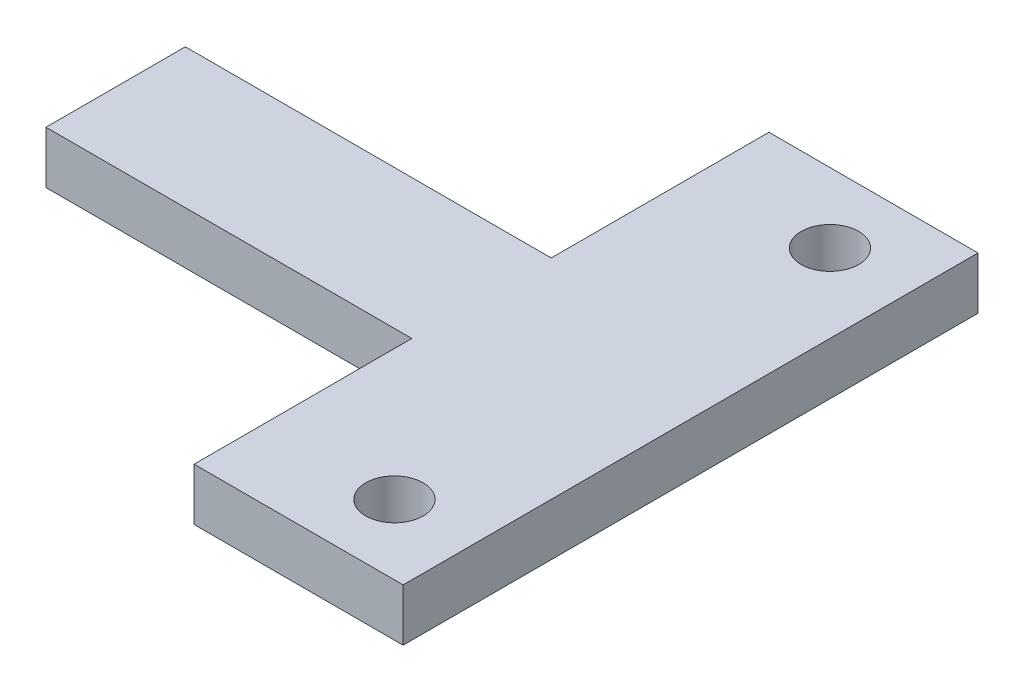
ISO-10303-21;
HEADER;
FILE_DESCRIPTION(('STEP AP214'),'2;1');
FILE_NAME('part.step','',(''),(''),'','','');
FILE_SCHEMA(('AUTOMOTIVE_DESIGN { 1 0 10303 214 1 1 1 1 }'));
ENDSEC;
DATA;
#1=APPLICATION_CONTEXT('core data for automotive mechanical design processes');
#2=APPLICATION_PROTOCOL_DEFINITION('international standard','automotive_design',2000,#1);
#3=PRODUCT_CONTEXT('',#1,'mechanical');
#4=PRODUCT('Part','Part','',(#3));
#5=PRODUCT_RELATED_PRODUCT_CATEGORY('part','',(#4));
#6=PRODUCT_DEFINITION_FORMATION('','',#4);
#7=PRODUCT_DEFINITION_CONTEXT('part definition',#1,'design');
#8=PRODUCT_DEFINITION('design','',#6,#7);
#9=PRODUCT_DEFINITION_SHAPE('','',#8);
#10=(LENGTH_UNIT() NAMED_UNIT(*) SI_UNIT(.MILLI.,.METRE.));
#11=(NAMED_UNIT(*) PLANE_ANGLE_UNIT() SI_UNIT($,.RADIAN.));
#12=(NAMED_UNIT(*) SI_UNIT($,.STERADIAN.) SOLID_ANGLE_UNIT());
#13=UNCERTAINTY_MEASURE_WITH_UNIT(LENGTH_MEASURE(1.E-05),#10,'distance_accuracy_value','');
#14=(GEOMETRIC_REPRESENTATION_CONTEXT(3) GLOBAL_UNCERTAINTY_ASSIGNED_CONTEXT((#13)) GLOBAL_UNIT_ASSIGNED_CONTEXT((#10,
#11,#12)) REPRESENTATION_CONTEXT('',''));
#15=CARTESIAN_POINT('',(0.,0.,0.));
#16=DIRECTION('',(0.,0.,1.));
#17=DIRECTION('',(1.,0.,0.));
#18=AXIS2_PLACEMENT_3D('',#15,#16,#17);
#19=CARTESIAN_POINT('',(0.,3.,0.));
#20=DIRECTION('',(0.,1.,0.));
#21=DIRECTION('',(0.,0.,1.));
#22=AXIS2_PLACEMENT_3D('',#19,#20,#21);
#23=PLANE('',#22);
#24=CARTESIAN_POINT('',(18.,3.,-12.5));
#25=DIRECTION('',(0.,1.,0.));
#26=DIRECTION('',(0.,0.,1.));
#27=AXIS2_PLACEMENT_3D('',#24,#25,#26);
#28=CIRCLE('',#27,1.65000000000001);
#29=CARTESIAN_POINT('',(18.,3.,-10.85));
#30=VERTEX_POINT('',#29);
#31=EDGE_CURVE('E144',#30,#30,#28,.T.);
#32=ORIENTED_EDGE('',*,*,#31,.F.);
#33=EDGE_LOOP('',(#32));
#34=FACE_BOUND('',#33,.T.);
#35=DIRECTION('',(-1.,0.,0.));
#36=VECTOR('',#35,1.);
#37=CARTESIAN_POINT('',(10.5,3.,-4.));
#38=LINE('',#37,#36);
#39=CARTESIAN_POINT('',(10.5,3.,-4.));
#40=VERTEX_POINT('',#39);
#41=CARTESIAN_POINT('',(-10.5,3.,-4.));
#42=VERTEX_POINT('',#41);
#43=EDGE_CURVE('E155',#40,#42,#38,.T.);
#44=ORIENTED_EDGE('',*,*,#43,.T.);
#45=DIRECTION('',(0.,0.,1.));
#46=VECTOR('',#45,1.);
#47=CARTESIAN_POINT('',(-10.5,3.,-4.));
#48=LINE('',#47,#46);
#49=CARTESIAN_POINT('',(-10.5,3.,4.));
#50=VERTEX_POINT('',#49);
#51=EDGE_CURVE('E103',#42,#50,#48,.T.);
#52=ORIENTED_EDGE('',*,*,#51,.T.);
#53=DIRECTION('',(1.,0.,0.));
#54=VECTOR('',#53,1.);
#55=CARTESIAN_POINT('',(-10.5,3.,4.));
#56=LINE('',#55,#54);
#57=CARTESIAN_POINT('',(10.5,3.,4.));
#58=VERTEX_POINT('',#57);
#59=EDGE_CURVE('E170',#50,#58,#56,.T.);
#60=ORIENTED_EDGE('',*,*,#59,.T.);
#61=DIRECTION('',(0.,0.,1.));
#62=VECTOR('',#61,1.);
#63=CARTESIAN_POINT('',(10.5,3.,4.));
#64=LINE('',#63,#62);
#65=CARTESIAN_POINT('',(10.5,3.,16.5));
#66=VERTEX_POINT('',#65);
#67=EDGE_CURVE('E183',#58,#66,#64,.T.);
#68=ORIENTED_EDGE('',*,*,#67,.T.);
#69=DIRECTION('',(1.,0.,0.));
#70=VECTOR('',#69,1.);
#71=CARTESIAN_POINT('',(10.5,3.,16.5));
#72=LINE('',#71,#70);
#73=CARTESIAN_POINT('',(22.5,3.,16.5));
#74=VERTEX_POINT('',#73);
#75=EDGE_CURVE('E122',#66,#74,#72,.T.);
#76=ORIENTED_EDGE('',*,*,#75,.T.);
#77=DIRECTION('',(0.,0.,-1.));
#78=VECTOR('',#77,1.);
#79=CARTESIAN_POINT('',(22.5,3.,16.5));
#80=LINE('',#79,#78);
#81=CARTESIAN_POINT('',(22.5,3.,-16.5));
#82=VERTEX_POINT('',#81);
#83=EDGE_CURVE('E116',#74,#82,#80,.T.);
#84=ORIENTED_EDGE('',*,*,#83,.T.);
#85=DIRECTION('',(-1.,0.,0.));
#86=VECTOR('',#85,1.);
#87=CARTESIAN_POINT('',(22.5,3.,-16.5));
#88=LINE('',#87,#86);
#89=CARTESIAN_POINT('',(10.5,3.,-16.5));
#90=VERTEX_POINT('',#89);
#91=EDGE_CURVE('E120',#82,#90,#88,.T.);
#92=ORIENTED_EDGE('',*,*,#91,.T.);
#93=DIRECTION('',(0.,0.,1.));
#94=VECTOR('',#93,1.);
#95=CARTESIAN_POINT('',(10.5,3.,-16.5));
#96=LINE('',#95,#94);
#97=EDGE_CURVE('E60',#90,#40,#96,.T.);
#98=ORIENTED_EDGE('',*,*,#97,.T.);
#99=EDGE_LOOP('',(#44,#52,#60,#68,#76,#84,#92,#98));
#100=FACE_BOUND('',#99,.T.);
#101=CARTESIAN_POINT('',(18.,3.,12.5));
#102=DIRECTION('',(0.,1.,0.));
#103=DIRECTION('',(0.,0.,1.));
#104=AXIS2_PLACEMENT_3D('',#101,#102,#103);
#105=CIRCLE('',#104,1.65000000000001);
#106=CARTESIAN_POINT('',(18.,3.,14.15));
#107=VERTEX_POINT('',#106);
#108=EDGE_CURVE('E192',#107,#107,#105,.T.);
#109=ORIENTED_EDGE('',*,*,#108,.F.);
#110=EDGE_LOOP('',(#109));
#111=FACE_BOUND('',#110,.T.);
#112=ADVANCED_FACE('F43',(#34,#100,#111),#23,.T.);
#113=CARTESIAN_POINT('',(0.,0.,0.));
#114=DIRECTION('',(0.,1.,0.));
#115=DIRECTION('',(0.,0.,1.));
#116=AXIS2_PLACEMENT_3D('',#113,#114,#115);
#117=PLANE('',#116);
#118=DIRECTION('',(-1.,0.,0.));
#119=VECTOR('',#118,1.);
#120=CARTESIAN_POINT('',(10.5,0.,-4.));
#121=LINE('',#120,#119);
#122=CARTESIAN_POINT('',(10.5,0.,-4.));
#123=VERTEX_POINT('',#122);
#124=CARTESIAN_POINT('',(-10.5,0.,-4.));
#125=VERTEX_POINT('',#124);
#126=EDGE_CURVE('E140',#123,#125,#121,.T.);
#127=ORIENTED_EDGE('',*,*,#126,.F.);
#128=DIRECTION('',(0.,0.,1.));
#129=VECTOR('',#128,1.);
#130=CARTESIAN_POINT('',(10.5,0.,-16.5));
#131=LINE('',#130,#129);
#132=CARTESIAN_POINT('',(10.5,0.,-16.5));
#133=VERTEX_POINT('',#132);
#134=EDGE_CURVE('E95',#133,#123,#131,.T.);
#135=ORIENTED_EDGE('',*,*,#134,.F.);
#136=DIRECTION('',(-1.,0.,0.));
#137=VECTOR('',#136,1.);
#138=CARTESIAN_POINT('',(22.5,0.,-16.5));
#139=LINE('',#138,#137);
#140=CARTESIAN_POINT('',(22.5,0.,-16.5));
#141=VERTEX_POINT('',#140);
#142=EDGE_CURVE('E89',#141,#133,#139,.T.);
#143=ORIENTED_EDGE('',*,*,#142,.F.);
#144=DIRECTION('',(0.,0.,-1.));
#145=VECTOR('',#144,1.);
#146=CARTESIAN_POINT('',(22.5,0.,16.5));
#147=LINE('',#146,#145);
#148=CARTESIAN_POINT('',(22.5,0.,16.5));
#149=VERTEX_POINT('',#148);
#150=EDGE_CURVE('E130',#149,#141,#147,.T.);
#151=ORIENTED_EDGE('',*,*,#150,.F.);
#152=DIRECTION('',(1.,0.,0.));
#153=VECTOR('',#152,1.);
#154=CARTESIAN_POINT('',(10.5,0.,16.5));
#155=LINE('',#154,#153);
#156=CARTESIAN_POINT('',(10.5,0.,16.5));
#157=VERTEX_POINT('',#156);
#158=EDGE_CURVE('E150',#157,#149,#155,.T.);
#159=ORIENTED_EDGE('',*,*,#158,.F.);
#160=DIRECTION('',(0.,0.,1.));
#161=VECTOR('',#160,1.);
#162=CARTESIAN_POINT('',(10.5,0.,4.));
#163=LINE('',#162,#161);
#164=CARTESIAN_POINT('',(10.5,0.,4.));
#165=VERTEX_POINT('',#164);
#166=EDGE_CURVE('E148',#165,#157,#163,.T.);
#167=ORIENTED_EDGE('',*,*,#166,.F.);
#168=DIRECTION('',(1.,0.,0.));
#169=VECTOR('',#168,1.);
#170=CARTESIAN_POINT('',(-10.5,0.,4.));
#171=LINE('',#170,#169);
#172=CARTESIAN_POINT('',(-10.5,0.,4.));
#173=VERTEX_POINT('',#172);
#174=EDGE_CURVE('E146',#173,#165,#171,.T.);
#175=ORIENTED_EDGE('',*,*,#174,.F.);
#176=DIRECTION('',(0.,0.,1.));
#177=VECTOR('',#176,1.);
#178=CARTESIAN_POINT('',(-10.5,0.,-4.));
#179=LINE('',#178,#177);
#180=EDGE_CURVE('E143',#125,#173,#179,.T.);
#181=ORIENTED_EDGE('',*,*,#180,.F.);
#182=EDGE_LOOP('',(#127,#135,#143,#151,#159,#167,#175,#181));
#183=FACE_BOUND('',#182,.T.);
#184=CARTESIAN_POINT('',(18.,0.,-12.5));
#185=DIRECTION('',(0.,1.,0.));
#186=DIRECTION('',(0.,0.,1.));
#187=AXIS2_PLACEMENT_3D('',#184,#185,#186);
#188=CIRCLE('',#187,1.65000000000001);
#189=CARTESIAN_POINT('',(18.,0.,-10.85));
#190=VERTEX_POINT('',#189);
#191=EDGE_CURVE('E189',#190,#190,#188,.T.);
#192=ORIENTED_EDGE('',*,*,#191,.T.);
#193=EDGE_LOOP('',(#192));
#194=FACE_BOUND('',#193,.T.);
#195=CARTESIAN_POINT('',(18.,0.,12.5));
#196=DIRECTION('',(0.,1.,0.));
#197=DIRECTION('',(0.,0.,1.));
#198=AXIS2_PLACEMENT_3D('',#195,#196,#197);
#199=CIRCLE('',#198,1.65000000000001);
#200=CARTESIAN_POINT('',(18.,0.,14.15));
#201=VERTEX_POINT('',#200);
#202=EDGE_CURVE('E195',#201,#201,#199,.T.);
#203=ORIENTED_EDGE('',*,*,#202,.T.);
#204=EDGE_LOOP('',(#203));
#205=FACE_BOUND('',#204,.T.);
#206=ADVANCED_FACE('F174',(#183,#194,#205),#117,.F.);
#207=CARTESIAN_POINT('',(10.5,3.,-4.));
#208=DIRECTION('',(0.,0.,1.));
#209=DIRECTION('',(1.,0.,0.));
#210=AXIS2_PLACEMENT_3D('',#207,#208,#209);
#211=PLANE('',#210);
#212=ORIENTED_EDGE('',*,*,#126,.T.);
#213=DIRECTION('',(0.,-1.,0.));
#214=VECTOR('',#213,1.);
#215=CARTESIAN_POINT('',(-10.5,3.,-4.));
#216=LINE('',#215,#214);
#217=EDGE_CURVE('E11',#42,#125,#216,.T.);
#218=ORIENTED_EDGE('',*,*,#217,.F.);
#219=ORIENTED_EDGE('',*,*,#43,.F.);
#220=DIRECTION('',(0.,-1.,0.));
#221=VECTOR('',#220,1.);
#222=CARTESIAN_POINT('',(10.5,3.,-4.));
#223=LINE('',#222,#221);
#224=EDGE_CURVE('E136',#40,#123,#223,.T.);
#225=ORIENTED_EDGE('',*,*,#224,.T.);
#226=EDGE_LOOP('',(#212,#218,#219,#225));
#227=FACE_BOUND('',#226,.T.);
#228=ADVANCED_FACE('F45',(#227),#211,.F.);
#229=CARTESIAN_POINT('',(-10.5,3.,-4.));
#230=DIRECTION('',(1.,0.,0.));
#231=DIRECTION('',(0.,0.,-1.));
#232=AXIS2_PLACEMENT_3D('',#229,#230,#231);
#233=PLANE('',#232);
#234=ORIENTED_EDGE('',*,*,#180,.T.);
#235=DIRECTION('',(0.,-1.,0.));
#236=VECTOR('',#235,1.);
#237=CARTESIAN_POINT('',(-10.5,3.,4.));
#238=LINE('',#237,#236);
#239=EDGE_CURVE('E52',#50,#173,#238,.T.);
#240=ORIENTED_EDGE('',*,*,#239,.F.);
#241=ORIENTED_EDGE('',*,*,#51,.F.);
#242=ORIENTED_EDGE('',*,*,#217,.T.);
#243=EDGE_LOOP('',(#234,#240,#241,#242));
#244=FACE_BOUND('',#243,.T.);
#245=ADVANCED_FACE('F227',(#244),#233,.F.);
#246=CARTESIAN_POINT('',(-10.5,3.,4.));
#247=DIRECTION('',(0.,0.,-1.));
#248=DIRECTION('',(-1.,0.,0.));
#249=AXIS2_PLACEMENT_3D('',#246,#247,#248);
#250=PLANE('',#249);
#251=ORIENTED_EDGE('',*,*,#174,.T.);
#252=DIRECTION('',(0.,-1.,0.));
#253=VECTOR('',#252,1.);
#254=CARTESIAN_POINT('',(10.5,3.,4.));
#255=LINE('',#254,#253);
#256=EDGE_CURVE('E162',#58,#165,#255,.T.);
#257=ORIENTED_EDGE('',*,*,#256,.F.);
#258=ORIENTED_EDGE('',*,*,#59,.F.);
#259=ORIENTED_EDGE('',*,*,#239,.T.);
#260=EDGE_LOOP('',(#251,#257,#258,#259));
#261=FACE_BOUND('',#260,.T.);
#262=ADVANCED_FACE('F168',(#261),#250,.F.);
#263=CARTESIAN_POINT('',(10.5,3.,4.));
#264=DIRECTION('',(1.,0.,0.));
#265=DIRECTION('',(0.,0.,-1.));
#266=AXIS2_PLACEMENT_3D('',#263,#264,#265);
#267=PLANE('',#266);
#268=ORIENTED_EDGE('',*,*,#166,.T.);
#269=DIRECTION('',(0.,-1.,0.));
#270=VECTOR('',#269,1.);
#271=CARTESIAN_POINT('',(10.5,3.,16.5));
#272=LINE('',#271,#270);
#273=EDGE_CURVE('E159',#66,#157,#272,.T.);
#274=ORIENTED_EDGE('',*,*,#273,.F.);
#275=ORIENTED_EDGE('',*,*,#67,.F.);
#276=ORIENTED_EDGE('',*,*,#256,.T.);
#277=EDGE_LOOP('',(#268,#274,#275,#276));
#278=FACE_BOUND('',#277,.T.);
#279=ADVANCED_FACE('F179',(#278),#267,.F.);
#280=CARTESIAN_POINT('',(10.5,3.,16.5));
#281=DIRECTION('',(0.,0.,-1.));
#282=DIRECTION('',(-1.,0.,0.));
#283=AXIS2_PLACEMENT_3D('',#280,#281,#282);
#284=PLANE('',#283);
#285=ORIENTED_EDGE('',*,*,#158,.T.);
#286=DIRECTION('',(0.,-1.,0.));
#287=VECTOR('',#286,1.);
#288=CARTESIAN_POINT('',(22.5,3.,16.5));
#289=LINE('',#288,#287);
#290=EDGE_CURVE('E131',#74,#149,#289,.T.);
#291=ORIENTED_EDGE('',*,*,#290,.F.);
#292=ORIENTED_EDGE('',*,*,#75,.F.);
#293=ORIENTED_EDGE('',*,*,#273,.T.);
#294=EDGE_LOOP('',(#285,#291,#292,#293));
#295=FACE_BOUND('',#294,.T.);
#296=ADVANCED_FACE('F182',(#295),#284,.F.);
#297=CARTESIAN_POINT('',(22.5,3.,16.5));
#298=DIRECTION('',(-1.,0.,0.));
#299=DIRECTION('',(0.,0.,1.));
#300=AXIS2_PLACEMENT_3D('',#297,#298,#299);
#301=PLANE('',#300);
#302=ORIENTED_EDGE('',*,*,#150,.T.);
#303=DIRECTION('',(0.,-1.,0.));
#304=VECTOR('',#303,1.);
#305=CARTESIAN_POINT('',(22.5,3.,-16.5));
#306=LINE('',#305,#304);
#307=EDGE_CURVE('E127',#82,#141,#306,.T.);
#308=ORIENTED_EDGE('',*,*,#307,.F.);
#309=ORIENTED_EDGE('',*,*,#83,.F.);
#310=ORIENTED_EDGE('',*,*,#290,.T.);
#311=EDGE_LOOP('',(#302,#308,#309,#310));
#312=FACE_BOUND('',#311,.T.);
#313=ADVANCED_FACE('F128',(#312),#301,.F.);
#314=CARTESIAN_POINT('',(22.5,3.,-16.5));
#315=DIRECTION('',(0.,0.,1.));
#316=DIRECTION('',(1.,0.,0.));
#317=AXIS2_PLACEMENT_3D('',#314,#315,#316);
#318=PLANE('',#317);
#319=ORIENTED_EDGE('',*,*,#142,.T.);
#320=DIRECTION('',(0.,-1.,0.));
#321=VECTOR('',#320,1.);
#322=CARTESIAN_POINT('',(10.5,3.,-16.5));
#323=LINE('',#322,#321);
#324=EDGE_CURVE('E132',#90,#133,#323,.T.);
#325=ORIENTED_EDGE('',*,*,#324,.F.);
#326=ORIENTED_EDGE('',*,*,#91,.F.);
#327=ORIENTED_EDGE('',*,*,#307,.T.);
#328=EDGE_LOOP('',(#319,#325,#326,#327));
#329=FACE_BOUND('',#328,.T.);
#330=ADVANCED_FACE('F134',(#329),#318,.F.);
#331=CARTESIAN_POINT('',(10.5,3.,-16.5));
#332=DIRECTION('',(1.,0.,0.));
#333=DIRECTION('',(0.,0.,-1.));
#334=AXIS2_PLACEMENT_3D('',#331,#332,#333);
#335=PLANE('',#334);
#336=ORIENTED_EDGE('',*,*,#134,.T.);
#337=ORIENTED_EDGE('',*,*,#224,.F.);
#338=ORIENTED_EDGE('',*,*,#97,.F.);
#339=ORIENTED_EDGE('',*,*,#324,.T.);
#340=EDGE_LOOP('',(#336,#337,#338,#339));
#341=FACE_BOUND('',#340,.T.);
#342=ADVANCED_FACE('F215',(#341),#335,.F.);
#343=CARTESIAN_POINT('',(18.,3.,-12.5));
#344=DIRECTION('',(0.,-1.,0.));
#345=DIRECTION('',(0.,0.,-1.));
#346=AXIS2_PLACEMENT_3D('',#343,#344,#345);
#347=CYLINDRICAL_SURFACE('',#346,1.65000000000001);
#348=ORIENTED_EDGE('',*,*,#31,.T.);
#349=EDGE_LOOP('',(#348));
#350=FACE_BOUND('',#349,.T.);
#351=ORIENTED_EDGE('',*,*,#191,.F.);
#352=EDGE_LOOP('',(#351));
#353=FACE_BOUND('',#352,.T.);
#354=ADVANCED_FACE('F212',(#350,#353),#347,.F.);
#355=CARTESIAN_POINT('',(18.,3.,12.5));
#356=DIRECTION('',(0.,-1.,0.));
#357=DIRECTION('',(0.,0.,-1.));
#358=AXIS2_PLACEMENT_3D('',#355,#356,#357);
#359=CYLINDRICAL_SURFACE('',#358,1.65000000000001);
#360=ORIENTED_EDGE('',*,*,#108,.T.);
#361=EDGE_LOOP('',(#360));
#362=FACE_BOUND('',#361,.T.);
#363=ORIENTED_EDGE('',*,*,#202,.F.);
#364=EDGE_LOOP('',(#363));
#365=FACE_BOUND('',#364,.T.);
#366=ADVANCED_FACE('F201',(#362,#365),#359,.F.);
#367=CLOSED_SHELL('',(#112,#206,#228,#245,#262,#279,#296,#313,#330,#342,#354,#366));
#368=MANIFOLD_SOLID_BREP('B2',#367);
#369=ADVANCED_BREP_SHAPE_REPRESENTATION('',(#18,#368),#14);
#370=SHAPE_DEFINITION_REPRESENTATION(#9,#369);
ENDSEC;
END-ISO-10303-21;
